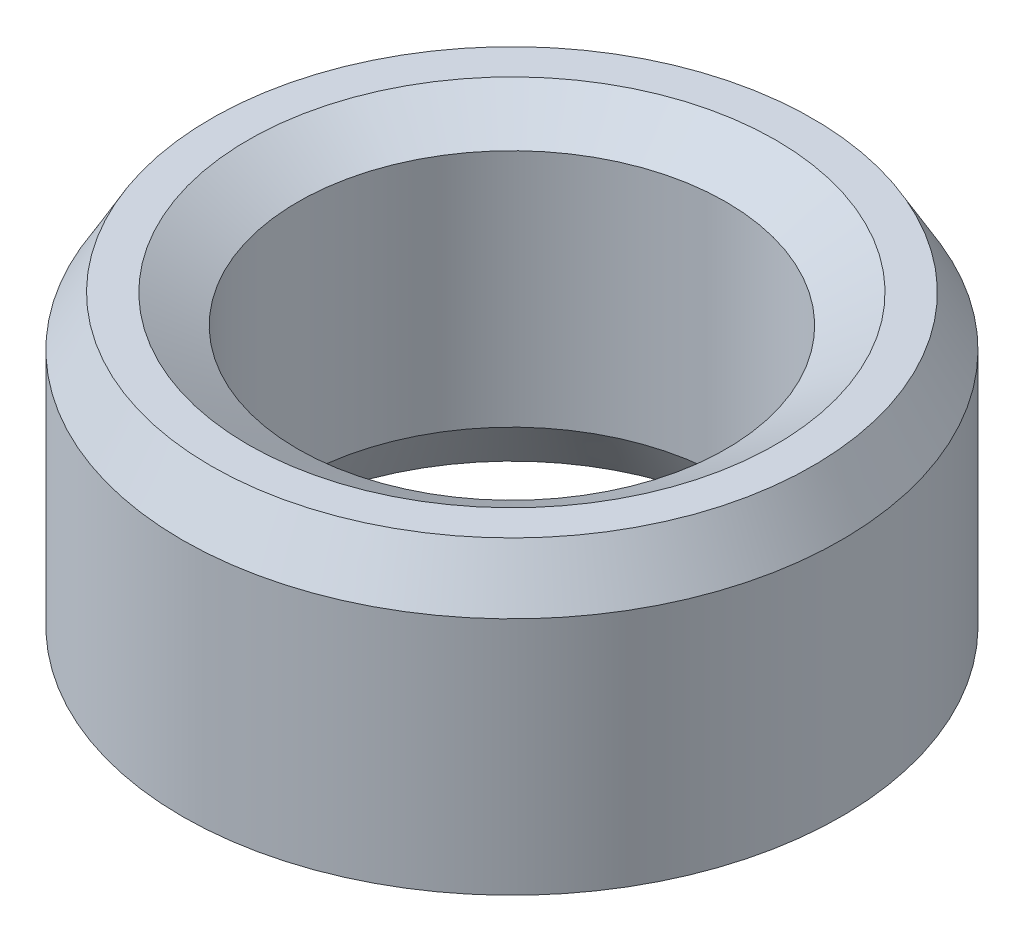
ISO-10303-21;
HEADER;
FILE_DESCRIPTION(('STEP AP214'),'2;1');
FILE_NAME('part.step','',(''),(''),'','','');
FILE_SCHEMA(('AUTOMOTIVE_DESIGN { 1 0 10303 214 1 1 1 1 }'));
ENDSEC;
DATA;
#1=APPLICATION_CONTEXT('core data for automotive mechanical design processes');
#2=APPLICATION_PROTOCOL_DEFINITION('international standard','automotive_design',2000,#1);
#3=PRODUCT_CONTEXT('',#1,'mechanical');
#4=PRODUCT('Part','Part','',(#3));
#5=PRODUCT_RELATED_PRODUCT_CATEGORY('part','',(#4));
#6=PRODUCT_DEFINITION_FORMATION('','',#4);
#7=PRODUCT_DEFINITION_CONTEXT('part definition',#1,'design');
#8=PRODUCT_DEFINITION('design','',#6,#7);
#9=PRODUCT_DEFINITION_SHAPE('','',#8);
#10=(LENGTH_UNIT() NAMED_UNIT(*) SI_UNIT(.MILLI.,.METRE.));
#11=(NAMED_UNIT(*) PLANE_ANGLE_UNIT() SI_UNIT($,.RADIAN.));
#12=(NAMED_UNIT(*) SI_UNIT($,.STERADIAN.) SOLID_ANGLE_UNIT());
#13=UNCERTAINTY_MEASURE_WITH_UNIT(LENGTH_MEASURE(1.E-05),#10,'distance_accuracy_value','');
#14=(GEOMETRIC_REPRESENTATION_CONTEXT(3) GLOBAL_UNCERTAINTY_ASSIGNED_CONTEXT((#13)) GLOBAL_UNIT_ASSIGNED_CONTEXT((#10,
#11,#12)) REPRESENTATION_CONTEXT('',''));
#15=CARTESIAN_POINT('',(0.,0.,0.));
#16=DIRECTION('',(0.,0.,1.));
#17=DIRECTION('',(1.,0.,0.));
#18=AXIS2_PLACEMENT_3D('',#15,#16,#17);
#19=CARTESIAN_POINT('',(0.,7.23436734759112,0.));
#20=DIRECTION('',(0.,-1.,0.));
#21=DIRECTION('',(0.,0.,-1.));
#22=AXIS2_PLACEMENT_3D('',#19,#20,#21);
#23=CYLINDRICAL_SURFACE('',#22,7.5);
#24=CARTESIAN_POINT('',(0.,0.653821062774894,0.));
#25=DIRECTION('',(0.,1.,0.));
#26=DIRECTION('',(0.,0.,1.));
#27=AXIS2_PLACEMENT_3D('',#24,#25,#26);
#28=CIRCLE('',#27,7.5);
#29=CARTESIAN_POINT('',(0.,0.653821062774894,7.5));
#30=VERTEX_POINT('',#29);
#31=EDGE_CURVE('E10',#30,#30,#28,.T.);
#32=ORIENTED_EDGE('',*,*,#31,.T.);
#33=EDGE_LOOP('',(#32));
#34=FACE_BOUND('',#33,.T.);
#35=CARTESIAN_POINT('',(0.,6.1019160478063,0.));
#36=DIRECTION('',(0.,1.,0.));
#37=DIRECTION('',(0.,0.,1.));
#38=AXIS2_PLACEMENT_3D('',#35,#36,#37);
#39=CIRCLE('',#38,7.5);
#40=CARTESIAN_POINT('',(0.,6.1019160478063,7.5));
#41=VERTEX_POINT('',#40);
#42=EDGE_CURVE('E50',#41,#41,#39,.F.);
#43=ORIENTED_EDGE('',*,*,#42,.T.);
#44=EDGE_LOOP('',(#43));
#45=FACE_BOUND('',#44,.T.);
#46=ADVANCED_FACE('F39',(#34,#45),#23,.T.);
#47=CARTESIAN_POINT('',(0.,7.23436734759112,0.));
#48=DIRECTION('',(0.,1.,0.));
#49=DIRECTION('',(0.,0.,1.));
#50=AXIS2_PLACEMENT_3D('',#47,#48,#49);
#51=PLANE('',#50);
#52=CARTESIAN_POINT('',(0.,7.23436734759112,0.));
#53=DIRECTION('',(0.,1.,0.));
#54=DIRECTION('',(0.,0.,1.));
#55=AXIS2_PLACEMENT_3D('',#52,#53,#54);
#56=CIRCLE('',#55,6.0043116295761);
#57=CARTESIAN_POINT('',(0.,7.23436734759112,6.0043116295761));
#58=VERTEX_POINT('',#57);
#59=EDGE_CURVE('E58',#58,#58,#56,.F.);
#60=ORIENTED_EDGE('',*,*,#59,.T.);
#61=EDGE_LOOP('',(#60));
#62=FACE_BOUND('',#61,.T.);
#63=CARTESIAN_POINT('',(0.,7.23436734759112,0.));
#64=DIRECTION('',(0.,1.,0.));
#65=DIRECTION('',(0.,0.,1.));
#66=AXIS2_PLACEMENT_3D('',#63,#64,#65);
#67=CIRCLE('',#66,6.8461789372251);
#68=CARTESIAN_POINT('',(0.,7.23436734759112,6.8461789372251));
#69=VERTEX_POINT('',#68);
#70=EDGE_CURVE('E61',#69,#69,#67,.T.);
#71=ORIENTED_EDGE('',*,*,#70,.T.);
#72=EDGE_LOOP('',(#71));
#73=FACE_BOUND('',#72,.T.);
#74=ADVANCED_FACE('F88',(#62,#73),#51,.T.);
#75=CARTESIAN_POINT('',(0.,0.,0.));
#76=DIRECTION('',(0.,1.,0.));
#77=DIRECTION('',(0.,0.,1.));
#78=AXIS2_PLACEMENT_3D('',#75,#76,#77);
#79=PLANE('',#78);
#80=CARTESIAN_POINT('',(0.,0.,0.));
#81=DIRECTION('',(0.,1.,0.));
#82=DIRECTION('',(0.,0.,1.));
#83=AXIS2_PLACEMENT_3D('',#80,#81,#82);
#84=CIRCLE('',#83,5.52568139256619);
#85=CARTESIAN_POINT('',(0.,0.,5.52568139256619));
#86=VERTEX_POINT('',#85);
#87=EDGE_CURVE('E51',#86,#86,#84,.T.);
#88=ORIENTED_EDGE('',*,*,#87,.T.);
#89=EDGE_LOOP('',(#88));
#90=FACE_BOUND('',#89,.T.);
#91=CARTESIAN_POINT('',(0.,0.,0.));
#92=DIRECTION('',(0.,1.,0.));
#93=DIRECTION('',(0.,0.,1.));
#94=AXIS2_PLACEMENT_3D('',#91,#92,#93);
#95=CIRCLE('',#94,6.36754870021519);
#96=CARTESIAN_POINT('',(0.,0.,6.36754870021519));
#97=VERTEX_POINT('',#96);
#98=EDGE_CURVE('E54',#97,#97,#95,.F.);
#99=ORIENTED_EDGE('',*,*,#98,.T.);
#100=EDGE_LOOP('',(#99));
#101=FACE_BOUND('',#100,.T.);
#102=ADVANCED_FACE('F83',(#90,#101),#79,.F.);
#103=CARTESIAN_POINT('',(0.,7.23436734759112,0.));
#104=DIRECTION('',(0.,-1.,0.));
#105=DIRECTION('',(0.,0.,-1.));
#106=AXIS2_PLACEMENT_3D('',#103,#104,#105);
#107=CYLINDRICAL_SURFACE('',#106,4.87186032979129);
#108=CARTESIAN_POINT('',(0.,6.58054628481622,0.));
#109=DIRECTION('',(0.,1.,0.));
#110=DIRECTION('',(0.,0.,1.));
#111=AXIS2_PLACEMENT_3D('',#108,#109,#110);
#112=CIRCLE('',#111,4.87186032979129);
#113=CARTESIAN_POINT('',(0.,6.58054628481622,4.87186032979129));
#114=VERTEX_POINT('',#113);
#115=EDGE_CURVE('E67',#114,#114,#112,.T.);
#116=ORIENTED_EDGE('',*,*,#115,.T.);
#117=EDGE_LOOP('',(#116));
#118=FACE_BOUND('',#117,.T.);
#119=CARTESIAN_POINT('',(0.,1.13245129978481,0.));
#120=DIRECTION('',(0.,1.,0.));
#121=DIRECTION('',(0.,0.,1.));
#122=AXIS2_PLACEMENT_3D('',#119,#120,#121);
#123=CIRCLE('',#122,4.87186032979129);
#124=CARTESIAN_POINT('',(0.,1.13245129978481,4.87186032979129));
#125=VERTEX_POINT('',#124);
#126=EDGE_CURVE('E69',#125,#125,#123,.F.);
#127=ORIENTED_EDGE('',*,*,#126,.T.);
#128=EDGE_LOOP('',(#127));
#129=FACE_BOUND('',#128,.T.);
#130=ADVANCED_FACE('F71',(#118,#129),#107,.F.);
#131=CARTESIAN_POINT('',(0.,6.58054628481622,0.));
#132=DIRECTION('',(0.,1.,0.));
#133=DIRECTION('',(0.,0.,1.));
#134=AXIS2_PLACEMENT_3D('',#131,#132,#133);
#135=CONICAL_SURFACE('',#134,4.87186032979129,1.0471975511966);
#136=ORIENTED_EDGE('',*,*,#59,.F.);
#137=EDGE_LOOP('',(#136));
#138=FACE_BOUND('',#137,.T.);
#139=ORIENTED_EDGE('',*,*,#115,.F.);
#140=EDGE_LOOP('',(#139));
#141=FACE_BOUND('',#140,.T.);
#142=ADVANCED_FACE('F77',(#138,#141),#135,.F.);
#143=CARTESIAN_POINT('',(0.,0.,0.));
#144=DIRECTION('',(0.,-1.,0.));
#145=DIRECTION('',(0.,0.,-1.));
#146=AXIS2_PLACEMENT_3D('',#143,#144,#145);
#147=CONICAL_SURFACE('',#146,5.52568139256619,0.523598775598295);
#148=ORIENTED_EDGE('',*,*,#126,.F.);
#149=EDGE_LOOP('',(#148));
#150=FACE_BOUND('',#149,.T.);
#151=ORIENTED_EDGE('',*,*,#87,.F.);
#152=EDGE_LOOP('',(#151));
#153=FACE_BOUND('',#152,.T.);
#154=ADVANCED_FACE('F73',(#150,#153),#147,.F.);
#155=CARTESIAN_POINT('',(0.,0.653821062774894,0.));
#156=DIRECTION('',(0.,1.,0.));
#157=DIRECTION('',(0.,0.,1.));
#158=AXIS2_PLACEMENT_3D('',#155,#156,#157);
#159=CONICAL_SURFACE('',#158,7.5,1.0471975511966);
#160=ORIENTED_EDGE('',*,*,#98,.F.);
#161=EDGE_LOOP('',(#160));
#162=FACE_BOUND('',#161,.T.);
#163=ORIENTED_EDGE('',*,*,#31,.F.);
#164=EDGE_LOOP('',(#163));
#165=FACE_BOUND('',#164,.T.);
#166=ADVANCED_FACE('F76',(#162,#165),#159,.T.);
#167=CARTESIAN_POINT('',(0.,7.23436734759112,0.));
#168=DIRECTION('',(0.,-1.,0.));
#169=DIRECTION('',(0.,0.,-1.));
#170=AXIS2_PLACEMENT_3D('',#167,#168,#169);
#171=CONICAL_SURFACE('',#170,6.8461789372251,0.523598775598295);
#172=ORIENTED_EDGE('',*,*,#42,.F.);
#173=EDGE_LOOP('',(#172));
#174=FACE_BOUND('',#173,.T.);
#175=ORIENTED_EDGE('',*,*,#70,.F.);
#176=EDGE_LOOP('',(#175));
#177=FACE_BOUND('',#176,.T.);
#178=ADVANCED_FACE('F45',(#174,#177),#171,.T.);
#179=CLOSED_SHELL('',(#46,#74,#102,#130,#142,#154,#166,#178));
#180=MANIFOLD_SOLID_BREP('B2',#179);
#181=ADVANCED_BREP_SHAPE_REPRESENTATION('',(#18,#180),#14);
#182=SHAPE_DEFINITION_REPRESENTATION(#9,#181);
ENDSEC;
END-ISO-10303-21;
